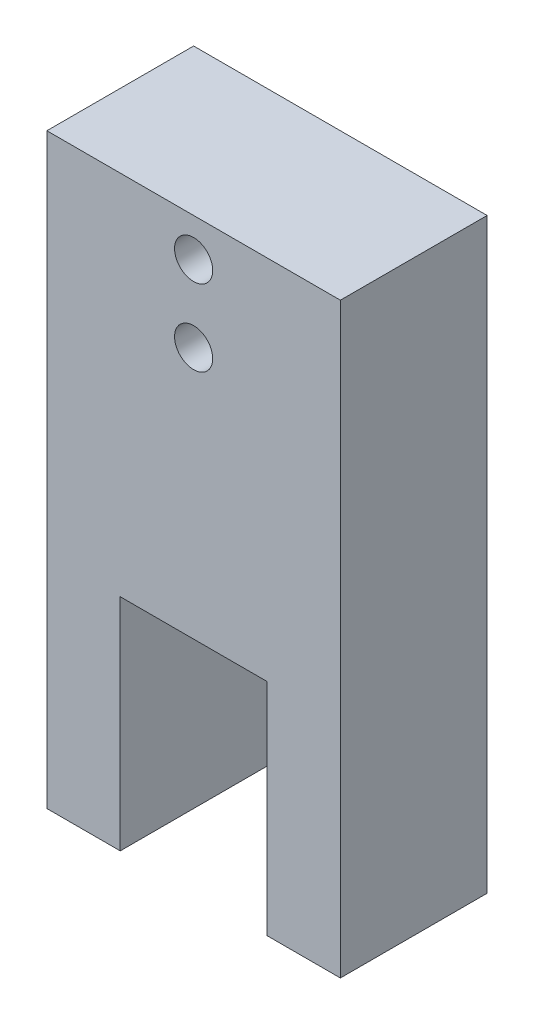
ISO-10303-21;
HEADER;
FILE_DESCRIPTION(('STEP AP214'),'2;1');
FILE_NAME('part.step','',(''),(''),'','','');
FILE_SCHEMA(('AUTOMOTIVE_DESIGN { 1 0 10303 214 1 1 1 1 }'));
ENDSEC;
DATA;
#1=APPLICATION_CONTEXT('core data for automotive mechanical design processes');
#2=APPLICATION_PROTOCOL_DEFINITION('international standard','automotive_design',2000,#1);
#3=PRODUCT_CONTEXT('',#1,'mechanical');
#4=PRODUCT('Part','Part','',(#3));
#5=PRODUCT_RELATED_PRODUCT_CATEGORY('part','',(#4));
#6=PRODUCT_DEFINITION_FORMATION('','',#4);
#7=PRODUCT_DEFINITION_CONTEXT('part definition',#1,'design');
#8=PRODUCT_DEFINITION('design','',#6,#7);
#9=PRODUCT_DEFINITION_SHAPE('','',#8);
#10=(LENGTH_UNIT() NAMED_UNIT(*) SI_UNIT(.MILLI.,.METRE.));
#11=(NAMED_UNIT(*) PLANE_ANGLE_UNIT() SI_UNIT($,.RADIAN.));
#12=(NAMED_UNIT(*) SI_UNIT($,.STERADIAN.) SOLID_ANGLE_UNIT());
#13=UNCERTAINTY_MEASURE_WITH_UNIT(LENGTH_MEASURE(1.E-05),#10,'distance_accuracy_value','');
#14=(GEOMETRIC_REPRESENTATION_CONTEXT(3) GLOBAL_UNCERTAINTY_ASSIGNED_CONTEXT((#13)) GLOBAL_UNIT_ASSIGNED_CONTEXT((#10,
#11,#12)) REPRESENTATION_CONTEXT('',''));
#15=CARTESIAN_POINT('',(0.,0.,0.));
#16=DIRECTION('',(0.,0.,1.));
#17=DIRECTION('',(1.,0.,0.));
#18=AXIS2_PLACEMENT_3D('',#15,#16,#17);
#19=CARTESIAN_POINT('',(38.1,0.,25.4));
#20=DIRECTION('',(-1.,0.,0.));
#21=DIRECTION('',(0.,0.,1.));
#22=AXIS2_PLACEMENT_3D('',#19,#20,#21);
#23=PLANE('',#22);
#24=DIRECTION('',(0.,1.,0.));
#25=VECTOR('',#24,1.);
#26=CARTESIAN_POINT('',(38.1,0.,0.));
#27=LINE('',#26,#25);
#28=CARTESIAN_POINT('',(38.1,0.,0.));
#29=VERTEX_POINT('',#28);
#30=CARTESIAN_POINT('',(38.1,38.1,0.));
#31=VERTEX_POINT('',#30);
#32=EDGE_CURVE('E168',#29,#31,#27,.T.);
#33=ORIENTED_EDGE('',*,*,#32,.F.);
#34=DIRECTION('',(0.,0.,-1.));
#35=VECTOR('',#34,1.);
#36=CARTESIAN_POINT('',(38.1,0.,25.4));
#37=LINE('',#36,#35);
#38=CARTESIAN_POINT('',(38.1,0.,25.4));
#39=VERTEX_POINT('',#38);
#40=EDGE_CURVE('E11',#39,#29,#37,.T.);
#41=ORIENTED_EDGE('',*,*,#40,.F.);
#42=DIRECTION('',(0.,1.,0.));
#43=VECTOR('',#42,1.);
#44=CARTESIAN_POINT('',(38.1,0.,25.4));
#45=LINE('',#44,#43);
#46=CARTESIAN_POINT('',(38.1,38.1,25.4));
#47=VERTEX_POINT('',#46);
#48=EDGE_CURVE('E250',#39,#47,#45,.T.);
#49=ORIENTED_EDGE('',*,*,#48,.T.);
#50=DIRECTION('',(0.,0.,-1.));
#51=VECTOR('',#50,1.);
#52=CARTESIAN_POINT('',(38.1,38.1,25.4));
#53=LINE('',#52,#51);
#54=EDGE_CURVE('E93',#47,#31,#53,.T.);
#55=ORIENTED_EDGE('',*,*,#54,.T.);
#56=EDGE_LOOP('',(#33,#41,#49,#55));
#57=FACE_BOUND('',#56,.T.);
#58=ADVANCED_FACE('F41',(#57),#23,.T.);
#59=CARTESIAN_POINT('',(0.,0.,25.4));
#60=DIRECTION('',(0.,1.,0.));
#61=DIRECTION('',(0.,0.,1.));
#62=AXIS2_PLACEMENT_3D('',#59,#60,#61);
#63=PLANE('',#62);
#64=DIRECTION('',(1.,0.,0.));
#65=VECTOR('',#64,1.);
#66=CARTESIAN_POINT('',(0.,0.,0.));
#67=LINE('',#66,#65);
#68=CARTESIAN_POINT('',(50.8,0.,0.));
#69=VERTEX_POINT('',#68);
#70=EDGE_CURVE('E165',#29,#69,#67,.T.);
#71=ORIENTED_EDGE('',*,*,#70,.T.);
#72=DIRECTION('',(0.,0.,-1.));
#73=VECTOR('',#72,1.);
#74=CARTESIAN_POINT('',(50.8,0.,25.4));
#75=LINE('',#74,#73);
#76=CARTESIAN_POINT('',(50.8,0.,25.4));
#77=VERTEX_POINT('',#76);
#78=EDGE_CURVE('E51',#77,#69,#75,.T.);
#79=ORIENTED_EDGE('',*,*,#78,.F.);
#80=DIRECTION('',(1.,0.,0.));
#81=VECTOR('',#80,1.);
#82=CARTESIAN_POINT('',(0.,0.,25.4));
#83=LINE('',#82,#81);
#84=EDGE_CURVE('E133',#39,#77,#83,.T.);
#85=ORIENTED_EDGE('',*,*,#84,.F.);
#86=ORIENTED_EDGE('',*,*,#40,.T.);
#87=EDGE_LOOP('',(#71,#79,#85,#86));
#88=FACE_BOUND('',#87,.T.);
#89=ADVANCED_FACE('F166',(#88),#63,.F.);
#90=CARTESIAN_POINT('',(50.8,0.,25.4));
#91=DIRECTION('',(-1.,0.,0.));
#92=DIRECTION('',(0.,0.,1.));
#93=AXIS2_PLACEMENT_3D('',#90,#91,#92);
#94=PLANE('',#93);
#95=DIRECTION('',(0.,1.,0.));
#96=VECTOR('',#95,1.);
#97=CARTESIAN_POINT('',(50.8,0.,0.));
#98=LINE('',#97,#96);
#99=CARTESIAN_POINT('',(50.8,101.6,0.));
#100=VERTEX_POINT('',#99);
#101=EDGE_CURVE('E159',#69,#100,#98,.T.);
#102=ORIENTED_EDGE('',*,*,#101,.T.);
#103=DIRECTION('',(0.,0.,-1.));
#104=VECTOR('',#103,1.);
#105=CARTESIAN_POINT('',(50.8,101.6,25.4));
#106=LINE('',#105,#104);
#107=CARTESIAN_POINT('',(50.8,101.6,25.4));
#108=VERTEX_POINT('',#107);
#109=EDGE_CURVE('E149',#108,#100,#106,.T.);
#110=ORIENTED_EDGE('',*,*,#109,.F.);
#111=DIRECTION('',(0.,1.,0.));
#112=VECTOR('',#111,1.);
#113=CARTESIAN_POINT('',(50.8,0.,25.4));
#114=LINE('',#113,#112);
#115=EDGE_CURVE('E161',#77,#108,#114,.T.);
#116=ORIENTED_EDGE('',*,*,#115,.F.);
#117=ORIENTED_EDGE('',*,*,#78,.T.);
#118=EDGE_LOOP('',(#102,#110,#116,#117));
#119=FACE_BOUND('',#118,.T.);
#120=ADVANCED_FACE('F157',(#119),#94,.F.);
#121=CARTESIAN_POINT('',(0.,101.6,25.4));
#122=DIRECTION('',(0.,1.,0.));
#123=DIRECTION('',(0.,0.,1.));
#124=AXIS2_PLACEMENT_3D('',#121,#122,#123);
#125=PLANE('',#124);
#126=DIRECTION('',(1.,0.,0.));
#127=VECTOR('',#126,1.);
#128=CARTESIAN_POINT('',(0.,101.6,0.));
#129=LINE('',#128,#127);
#130=CARTESIAN_POINT('',(0.,101.6,0.));
#131=VERTEX_POINT('',#130);
#132=EDGE_CURVE('E172',#131,#100,#129,.T.);
#133=ORIENTED_EDGE('',*,*,#132,.F.);
#134=DIRECTION('',(0.,0.,-1.));
#135=VECTOR('',#134,1.);
#136=CARTESIAN_POINT('',(0.,101.6,25.4));
#137=LINE('',#136,#135);
#138=CARTESIAN_POINT('',(0.,101.6,25.4));
#139=VERTEX_POINT('',#138);
#140=EDGE_CURVE('E142',#139,#131,#137,.T.);
#141=ORIENTED_EDGE('',*,*,#140,.F.);
#142=DIRECTION('',(1.,0.,0.));
#143=VECTOR('',#142,1.);
#144=CARTESIAN_POINT('',(0.,101.6,25.4));
#145=LINE('',#144,#143);
#146=EDGE_CURVE('E260',#139,#108,#145,.T.);
#147=ORIENTED_EDGE('',*,*,#146,.T.);
#148=ORIENTED_EDGE('',*,*,#109,.T.);
#149=EDGE_LOOP('',(#133,#141,#147,#148));
#150=FACE_BOUND('',#149,.T.);
#151=ADVANCED_FACE('F225',(#150),#125,.T.);
#152=CARTESIAN_POINT('',(0.,0.,25.4));
#153=DIRECTION('',(-1.,0.,0.));
#154=DIRECTION('',(0.,0.,1.));
#155=AXIS2_PLACEMENT_3D('',#152,#153,#154);
#156=PLANE('',#155);
#157=DIRECTION('',(0.,1.,0.));
#158=VECTOR('',#157,1.);
#159=CARTESIAN_POINT('',(0.,0.,0.));
#160=LINE('',#159,#158);
#161=CARTESIAN_POINT('',(0.,0.,0.));
#162=VERTEX_POINT('',#161);
#163=EDGE_CURVE('E178',#162,#131,#160,.T.);
#164=ORIENTED_EDGE('',*,*,#163,.F.);
#165=DIRECTION('',(0.,0.,-1.));
#166=VECTOR('',#165,1.);
#167=CARTESIAN_POINT('',(0.,0.,25.4));
#168=LINE('',#167,#166);
#169=CARTESIAN_POINT('',(0.,0.,25.4));
#170=VERTEX_POINT('',#169);
#171=EDGE_CURVE('E138',#170,#162,#168,.T.);
#172=ORIENTED_EDGE('',*,*,#171,.F.);
#173=DIRECTION('',(0.,1.,0.));
#174=VECTOR('',#173,1.);
#175=CARTESIAN_POINT('',(0.,0.,25.4));
#176=LINE('',#175,#174);
#177=EDGE_CURVE('E129',#170,#139,#176,.T.);
#178=ORIENTED_EDGE('',*,*,#177,.T.);
#179=ORIENTED_EDGE('',*,*,#140,.T.);
#180=EDGE_LOOP('',(#164,#172,#178,#179));
#181=FACE_BOUND('',#180,.T.);
#182=ADVANCED_FACE('F228',(#181),#156,.T.);
#183=CARTESIAN_POINT('',(12.7,0.,0.));
#184=VERTEX_POINT('',#183);
#185=EDGE_CURVE('E136',#162,#184,#67,.T.);
#186=ORIENTED_EDGE('',*,*,#185,.T.);
#187=DIRECTION('',(0.,0.,-1.));
#188=VECTOR('',#187,1.);
#189=CARTESIAN_POINT('',(12.7,0.,25.4));
#190=LINE('',#189,#188);
#191=CARTESIAN_POINT('',(12.7,0.,25.4));
#192=VERTEX_POINT('',#191);
#193=EDGE_CURVE('E118',#192,#184,#190,.T.);
#194=ORIENTED_EDGE('',*,*,#193,.F.);
#195=EDGE_CURVE('E122',#170,#192,#83,.T.);
#196=ORIENTED_EDGE('',*,*,#195,.F.);
#197=ORIENTED_EDGE('',*,*,#171,.T.);
#198=EDGE_LOOP('',(#186,#194,#196,#197));
#199=FACE_BOUND('',#198,.T.);
#200=ADVANCED_FACE('F134',(#199),#63,.F.);
#201=CARTESIAN_POINT('',(12.7,0.,25.4));
#202=DIRECTION('',(-1.,0.,0.));
#203=DIRECTION('',(0.,0.,1.));
#204=AXIS2_PLACEMENT_3D('',#201,#202,#203);
#205=PLANE('',#204);
#206=DIRECTION('',(0.,1.,0.));
#207=VECTOR('',#206,1.);
#208=CARTESIAN_POINT('',(12.7,0.,0.));
#209=LINE('',#208,#207);
#210=CARTESIAN_POINT('',(12.7,38.1,0.));
#211=VERTEX_POINT('',#210);
#212=EDGE_CURVE('E177',#184,#211,#209,.T.);
#213=ORIENTED_EDGE('',*,*,#212,.T.);
#214=DIRECTION('',(0.,0.,-1.));
#215=VECTOR('',#214,1.);
#216=CARTESIAN_POINT('',(12.7,38.1,25.4));
#217=LINE('',#216,#215);
#218=CARTESIAN_POINT('',(12.7,38.1,25.4));
#219=VERTEX_POINT('',#218);
#220=EDGE_CURVE('E120',#219,#211,#217,.T.);
#221=ORIENTED_EDGE('',*,*,#220,.F.);
#222=DIRECTION('',(0.,1.,0.));
#223=VECTOR('',#222,1.);
#224=CARTESIAN_POINT('',(12.7,0.,25.4));
#225=LINE('',#224,#223);
#226=EDGE_CURVE('E113',#192,#219,#225,.T.);
#227=ORIENTED_EDGE('',*,*,#226,.F.);
#228=ORIENTED_EDGE('',*,*,#193,.T.);
#229=EDGE_LOOP('',(#213,#221,#227,#228));
#230=FACE_BOUND('',#229,.T.);
#231=ADVANCED_FACE('F116',(#230),#205,.F.);
#232=CARTESIAN_POINT('',(25.4,94.996,25.4));
#233=DIRECTION('',(0.,0.,-1.));
#234=DIRECTION('',(-1.,0.,0.));
#235=AXIS2_PLACEMENT_3D('',#232,#233,#234);
#236=CYLINDRICAL_SURFACE('',#235,3.30199999999999);
#237=CARTESIAN_POINT('',(25.4,94.996,25.4));
#238=DIRECTION('',(0.,0.,1.));
#239=DIRECTION('',(1.,0.,0.));
#240=AXIS2_PLACEMENT_3D('',#237,#238,#239);
#241=CIRCLE('',#240,3.30199999999999);
#242=CARTESIAN_POINT('',(28.702,94.996,25.4));
#243=VERTEX_POINT('',#242);
#244=EDGE_CURVE('E248',#243,#243,#241,.T.);
#245=ORIENTED_EDGE('',*,*,#244,.T.);
#246=EDGE_LOOP('',(#245));
#247=FACE_BOUND('',#246,.T.);
#248=CARTESIAN_POINT('',(25.4,94.996,0.));
#249=DIRECTION('',(0.,0.,1.));
#250=DIRECTION('',(1.,0.,0.));
#251=AXIS2_PLACEMENT_3D('',#248,#249,#250);
#252=CIRCLE('',#251,3.30199999999999);
#253=CARTESIAN_POINT('',(28.702,94.996,0.));
#254=VERTEX_POINT('',#253);
#255=EDGE_CURVE('E174',#254,#254,#252,.T.);
#256=ORIENTED_EDGE('',*,*,#255,.F.);
#257=EDGE_LOOP('',(#256));
#258=FACE_BOUND('',#257,.T.);
#259=ADVANCED_FACE('F205',(#247,#258),#236,.F.);
#260=CARTESIAN_POINT('',(25.4,81.788,25.4));
#261=DIRECTION('',(0.,0.,-1.));
#262=DIRECTION('',(-1.,0.,0.));
#263=AXIS2_PLACEMENT_3D('',#260,#261,#262);
#264=CYLINDRICAL_SURFACE('',#263,3.30199999999999);
#265=CARTESIAN_POINT('',(25.4,81.788,25.4));
#266=DIRECTION('',(0.,0.,1.));
#267=DIRECTION('',(1.,0.,0.));
#268=AXIS2_PLACEMENT_3D('',#265,#266,#267);
#269=CIRCLE('',#268,3.30199999999999);
#270=CARTESIAN_POINT('',(28.702,81.788,25.4));
#271=VERTEX_POINT('',#270);
#272=EDGE_CURVE('E189',#271,#271,#269,.T.);
#273=ORIENTED_EDGE('',*,*,#272,.T.);
#274=EDGE_LOOP('',(#273));
#275=FACE_BOUND('',#274,.T.);
#276=CARTESIAN_POINT('',(25.4,81.788,0.));
#277=DIRECTION('',(0.,0.,1.));
#278=DIRECTION('',(1.,0.,0.));
#279=AXIS2_PLACEMENT_3D('',#276,#277,#278);
#280=CIRCLE('',#279,3.30199999999999);
#281=CARTESIAN_POINT('',(28.702,81.788,0.));
#282=VERTEX_POINT('',#281);
#283=EDGE_CURVE('E195',#282,#282,#280,.T.);
#284=ORIENTED_EDGE('',*,*,#283,.F.);
#285=EDGE_LOOP('',(#284));
#286=FACE_BOUND('',#285,.T.);
#287=ADVANCED_FACE('F43',(#275,#286),#264,.F.);
#288=CARTESIAN_POINT('',(0.,38.1,25.4));
#289=DIRECTION('',(0.,1.,0.));
#290=DIRECTION('',(0.,0.,1.));
#291=AXIS2_PLACEMENT_3D('',#288,#289,#290);
#292=PLANE('',#291);
#293=DIRECTION('',(1.,0.,0.));
#294=VECTOR('',#293,1.);
#295=CARTESIAN_POINT('',(0.,38.1,0.));
#296=LINE('',#295,#294);
#297=EDGE_CURVE('E86',#211,#31,#296,.T.);
#298=ORIENTED_EDGE('',*,*,#297,.T.);
#299=ORIENTED_EDGE('',*,*,#54,.F.);
#300=DIRECTION('',(1.,0.,0.));
#301=VECTOR('',#300,1.);
#302=CARTESIAN_POINT('',(0.,38.1,25.4));
#303=LINE('',#302,#301);
#304=EDGE_CURVE('E59',#219,#47,#303,.T.);
#305=ORIENTED_EDGE('',*,*,#304,.F.);
#306=ORIENTED_EDGE('',*,*,#220,.T.);
#307=EDGE_LOOP('',(#298,#299,#305,#306));
#308=FACE_BOUND('',#307,.T.);
#309=ADVANCED_FACE('F212',(#308),#292,.F.);
#310=CARTESIAN_POINT('',(0.,0.,25.4));
#311=DIRECTION('',(0.,0.,1.));
#312=DIRECTION('',(1.,0.,0.));
#313=AXIS2_PLACEMENT_3D('',#310,#311,#312);
#314=PLANE('',#313);
#315=ORIENTED_EDGE('',*,*,#272,.F.);
#316=EDGE_LOOP('',(#315));
#317=FACE_BOUND('',#316,.T.);
#318=ORIENTED_EDGE('',*,*,#244,.F.);
#319=EDGE_LOOP('',(#318));
#320=FACE_BOUND('',#319,.T.);
#321=ORIENTED_EDGE('',*,*,#48,.F.);
#322=ORIENTED_EDGE('',*,*,#84,.T.);
#323=ORIENTED_EDGE('',*,*,#115,.T.);
#324=ORIENTED_EDGE('',*,*,#146,.F.);
#325=ORIENTED_EDGE('',*,*,#177,.F.);
#326=ORIENTED_EDGE('',*,*,#195,.T.);
#327=ORIENTED_EDGE('',*,*,#226,.T.);
#328=ORIENTED_EDGE('',*,*,#304,.T.);
#329=EDGE_LOOP('',(#321,#322,#323,#324,#325,#326,#327,#328));
#330=FACE_BOUND('',#329,.T.);
#331=ADVANCED_FACE('F126',(#317,#320,#330),#314,.T.);
#332=CARTESIAN_POINT('',(0.,0.,0.));
#333=DIRECTION('',(0.,0.,1.));
#334=DIRECTION('',(1.,0.,0.));
#335=AXIS2_PLACEMENT_3D('',#332,#333,#334);
#336=PLANE('',#335);
#337=ORIENTED_EDGE('',*,*,#283,.T.);
#338=EDGE_LOOP('',(#337));
#339=FACE_BOUND('',#338,.T.);
#340=ORIENTED_EDGE('',*,*,#255,.T.);
#341=EDGE_LOOP('',(#340));
#342=FACE_BOUND('',#341,.T.);
#343=ORIENTED_EDGE('',*,*,#32,.T.);
#344=ORIENTED_EDGE('',*,*,#297,.F.);
#345=ORIENTED_EDGE('',*,*,#212,.F.);
#346=ORIENTED_EDGE('',*,*,#185,.F.);
#347=ORIENTED_EDGE('',*,*,#163,.T.);
#348=ORIENTED_EDGE('',*,*,#132,.T.);
#349=ORIENTED_EDGE('',*,*,#101,.F.);
#350=ORIENTED_EDGE('',*,*,#70,.F.);
#351=EDGE_LOOP('',(#343,#344,#345,#346,#347,#348,#349,#350));
#352=FACE_BOUND('',#351,.T.);
#353=ADVANCED_FACE('F203',(#339,#342,#352),#336,.F.);
#354=CLOSED_SHELL('',(#58,#89,#120,#151,#182,#200,#231,#259,#287,#309,#331,#353));
#355=MANIFOLD_SOLID_BREP('B2',#354);
#356=ADVANCED_BREP_SHAPE_REPRESENTATION('',(#18,#355),#14);
#357=SHAPE_DEFINITION_REPRESENTATION(#9,#356);
ENDSEC;
END-ISO-10303-21;
